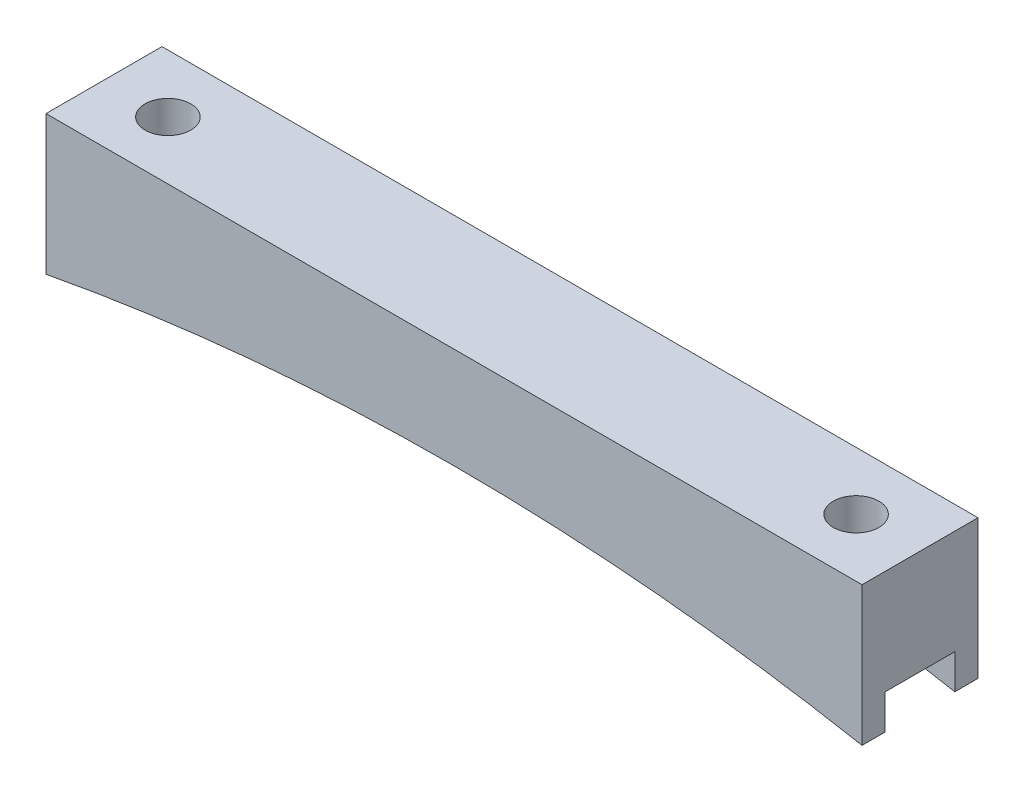
ISO-10303-21;
HEADER;
FILE_DESCRIPTION(('STEP AP214'),'2;1');
FILE_NAME('part.step','',(''),(''),'','','');
FILE_SCHEMA(('AUTOMOTIVE_DESIGN { 1 0 10303 214 1 1 1 1 }'));
ENDSEC;
DATA;
#1=APPLICATION_CONTEXT('core data for automotive mechanical design processes');
#2=APPLICATION_PROTOCOL_DEFINITION('international standard','automotive_design',2000,#1);
#3=PRODUCT_CONTEXT('',#1,'mechanical');
#4=PRODUCT('Part','Part','',(#3));
#5=PRODUCT_RELATED_PRODUCT_CATEGORY('part','',(#4));
#6=PRODUCT_DEFINITION_FORMATION('','',#4);
#7=PRODUCT_DEFINITION_CONTEXT('part definition',#1,'design');
#8=PRODUCT_DEFINITION('design','',#6,#7);
#9=PRODUCT_DEFINITION_SHAPE('','',#8);
#10=(LENGTH_UNIT() NAMED_UNIT(*) SI_UNIT(.MILLI.,.METRE.));
#11=(NAMED_UNIT(*) PLANE_ANGLE_UNIT() SI_UNIT($,.RADIAN.));
#12=(NAMED_UNIT(*) SI_UNIT($,.STERADIAN.) SOLID_ANGLE_UNIT());
#13=UNCERTAINTY_MEASURE_WITH_UNIT(LENGTH_MEASURE(1.E-05),#10,'distance_accuracy_value','');
#14=(GEOMETRIC_REPRESENTATION_CONTEXT(3) GLOBAL_UNCERTAINTY_ASSIGNED_CONTEXT((#13)) GLOBAL_UNIT_ASSIGNED_CONTEXT((#10,
#11,#12)) REPRESENTATION_CONTEXT('',''));
#15=CARTESIAN_POINT('',(0.,0.,0.));
#16=DIRECTION('',(0.,0.,1.));
#17=DIRECTION('',(1.,0.,0.));
#18=AXIS2_PLACEMENT_3D('',#15,#16,#17);
#19=CARTESIAN_POINT('',(44.68,0.,12.7));
#20=DIRECTION('',(-1.,0.,0.));
#21=DIRECTION('',(0.,0.,1.));
#22=AXIS2_PLACEMENT_3D('',#19,#20,#21);
#23=PLANE('',#22);
#24=DIRECTION('',(0.,0.,-1.));
#25=VECTOR('',#24,1.);
#26=CARTESIAN_POINT('',(44.68,-15.24,12.7));
#27=LINE('',#26,#25);
#28=CARTESIAN_POINT('',(44.68,-15.24,12.7));
#29=VERTEX_POINT('',#28);
#30=CARTESIAN_POINT('',(44.68,-15.24,10.16));
#31=VERTEX_POINT('',#30);
#32=EDGE_CURVE('E156',#29,#31,#27,.T.);
#33=ORIENTED_EDGE('',*,*,#32,.T.);
#34=DIRECTION('',(0.,-1.,0.));
#35=VECTOR('',#34,1.);
#36=CARTESIAN_POINT('',(44.68,-15.24,10.16));
#37=LINE('',#36,#35);
#38=CARTESIAN_POINT('',(44.68,-11.43,10.16));
#39=VERTEX_POINT('',#38);
#40=EDGE_CURVE('E185',#39,#31,#37,.T.);
#41=ORIENTED_EDGE('',*,*,#40,.F.);
#42=DIRECTION('',(0.,0.,1.));
#43=VECTOR('',#42,1.);
#44=CARTESIAN_POINT('',(44.68,-11.43,10.16));
#45=LINE('',#44,#43);
#46=CARTESIAN_POINT('',(44.68,-11.43,2.54));
#47=VERTEX_POINT('',#46);
#48=EDGE_CURVE('E141',#47,#39,#45,.T.);
#49=ORIENTED_EDGE('',*,*,#48,.F.);
#50=DIRECTION('',(0.,1.,0.));
#51=VECTOR('',#50,1.);
#52=CARTESIAN_POINT('',(44.68,-15.24,2.54));
#53=LINE('',#52,#51);
#54=CARTESIAN_POINT('',(44.68,-15.24,2.54));
#55=VERTEX_POINT('',#54);
#56=EDGE_CURVE('E177',#55,#47,#53,.T.);
#57=ORIENTED_EDGE('',*,*,#56,.F.);
#58=CARTESIAN_POINT('',(44.68,-15.24,0.));
#59=VERTEX_POINT('',#58);
#60=EDGE_CURVE('E174',#55,#59,#27,.T.);
#61=ORIENTED_EDGE('',*,*,#60,.T.);
#62=DIRECTION('',(0.,1.,0.));
#63=VECTOR('',#62,1.);
#64=CARTESIAN_POINT('',(44.68,0.,0.));
#65=LINE('',#64,#63);
#66=CARTESIAN_POINT('',(44.68,0.,0.));
#67=VERTEX_POINT('',#66);
#68=EDGE_CURVE('E213',#59,#67,#65,.T.);
#69=ORIENTED_EDGE('',*,*,#68,.T.);
#70=DIRECTION('',(0.,0.,-1.));
#71=VECTOR('',#70,1.);
#72=CARTESIAN_POINT('',(44.68,0.,12.7));
#73=LINE('',#72,#71);
#74=CARTESIAN_POINT('',(44.68,0.,12.7));
#75=VERTEX_POINT('',#74);
#76=EDGE_CURVE('E154',#75,#67,#73,.T.);
#77=ORIENTED_EDGE('',*,*,#76,.F.);
#78=DIRECTION('',(0.,1.,0.));
#79=VECTOR('',#78,1.);
#80=CARTESIAN_POINT('',(44.68,0.,12.7));
#81=LINE('',#80,#79);
#82=EDGE_CURVE('E217',#29,#75,#81,.T.);
#83=ORIENTED_EDGE('',*,*,#82,.F.);
#84=EDGE_LOOP('',(#33,#41,#49,#57,#61,#69,#77,#83));
#85=FACE_BOUND('',#84,.T.);
#86=ADVANCED_FACE('F43',(#85),#23,.F.);
#87=CARTESIAN_POINT('',(-44.68,0.,12.7));
#88=DIRECTION('',(0.,-1.,0.));
#89=DIRECTION('',(1.,0.,0.));
#90=AXIS2_PLACEMENT_3D('',#87,#88,#89);
#91=PLANE('',#90);
#92=CARTESIAN_POINT('',(-37.68,0.,6.35));
#93=DIRECTION('',(0.,1.,0.));
#94=DIRECTION('',(-1.,0.,0.));
#95=AXIS2_PLACEMENT_3D('',#92,#93,#94);
#96=CIRCLE('',#95,2.49999999999999);
#97=CARTESIAN_POINT('',(-40.18,0.,6.35));
#98=VERTEX_POINT('',#97);
#99=EDGE_CURVE('E209',#98,#98,#96,.T.);
#100=ORIENTED_EDGE('',*,*,#99,.F.);
#101=EDGE_LOOP('',(#100));
#102=FACE_BOUND('',#101,.T.);
#103=CARTESIAN_POINT('',(37.68,0.,6.35));
#104=DIRECTION('',(0.,1.,0.));
#105=DIRECTION('',(-1.,0.,0.));
#106=AXIS2_PLACEMENT_3D('',#103,#104,#105);
#107=CIRCLE('',#106,2.5);
#108=CARTESIAN_POINT('',(35.18,0.,6.35));
#109=VERTEX_POINT('',#108);
#110=EDGE_CURVE('E208',#109,#109,#107,.T.);
#111=ORIENTED_EDGE('',*,*,#110,.F.);
#112=EDGE_LOOP('',(#111));
#113=FACE_BOUND('',#112,.T.);
#114=DIRECTION('',(-1.,0.,0.));
#115=VECTOR('',#114,1.);
#116=CARTESIAN_POINT('',(-44.68,0.,0.));
#117=LINE('',#116,#115);
#118=CARTESIAN_POINT('',(-44.68,0.,0.));
#119=VERTEX_POINT('',#118);
#120=EDGE_CURVE('E232',#67,#119,#117,.T.);
#121=ORIENTED_EDGE('',*,*,#120,.T.);
#122=DIRECTION('',(0.,0.,-1.));
#123=VECTOR('',#122,1.);
#124=CARTESIAN_POINT('',(-44.68,0.,12.7));
#125=LINE('',#124,#123);
#126=CARTESIAN_POINT('',(-44.68,0.,12.7));
#127=VERTEX_POINT('',#126);
#128=EDGE_CURVE('E148',#127,#119,#125,.T.);
#129=ORIENTED_EDGE('',*,*,#128,.F.);
#130=DIRECTION('',(-1.,0.,0.));
#131=VECTOR('',#130,1.);
#132=CARTESIAN_POINT('',(-44.68,0.,12.7));
#133=LINE('',#132,#131);
#134=EDGE_CURVE('E221',#75,#127,#133,.T.);
#135=ORIENTED_EDGE('',*,*,#134,.F.);
#136=ORIENTED_EDGE('',*,*,#76,.T.);
#137=EDGE_LOOP('',(#121,#129,#135,#136));
#138=FACE_BOUND('',#137,.T.);
#139=ADVANCED_FACE('F247',(#102,#113,#138),#91,.F.);
#140=CARTESIAN_POINT('',(-44.68,0.,12.7));
#141=DIRECTION('',(1.,0.,0.));
#142=DIRECTION('',(0.,0.,-1.));
#143=AXIS2_PLACEMENT_3D('',#140,#141,#142);
#144=PLANE('',#143);
#145=DIRECTION('',(0.,0.,1.));
#146=VECTOR('',#145,1.);
#147=CARTESIAN_POINT('',(-44.68,-11.43,10.16));
#148=LINE('',#147,#146);
#149=CARTESIAN_POINT('',(-44.68,-11.43,2.54));
#150=VERTEX_POINT('',#149);
#151=CARTESIAN_POINT('',(-44.68,-11.43,10.16));
#152=VERTEX_POINT('',#151);
#153=EDGE_CURVE('E139',#150,#152,#148,.T.);
#154=ORIENTED_EDGE('',*,*,#153,.T.);
#155=DIRECTION('',(0.,-1.,0.));
#156=VECTOR('',#155,1.);
#157=CARTESIAN_POINT('',(-44.68,-15.24,10.16));
#158=LINE('',#157,#156);
#159=CARTESIAN_POINT('',(-44.68,-15.24,10.16));
#160=VERTEX_POINT('',#159);
#161=EDGE_CURVE('E124',#152,#160,#158,.T.);
#162=ORIENTED_EDGE('',*,*,#161,.T.);
#163=DIRECTION('',(0.,0.,-1.));
#164=VECTOR('',#163,1.);
#165=CARTESIAN_POINT('',(-44.68,-15.24,12.7));
#166=LINE('',#165,#164);
#167=CARTESIAN_POINT('',(-44.68,-15.24,12.7));
#168=VERTEX_POINT('',#167);
#169=EDGE_CURVE('E136',#168,#160,#166,.T.);
#170=ORIENTED_EDGE('',*,*,#169,.F.);
#171=DIRECTION('',(0.,-1.,0.));
#172=VECTOR('',#171,1.);
#173=CARTESIAN_POINT('',(-44.68,0.,12.7));
#174=LINE('',#173,#172);
#175=EDGE_CURVE('E225',#127,#168,#174,.T.);
#176=ORIENTED_EDGE('',*,*,#175,.F.);
#177=ORIENTED_EDGE('',*,*,#128,.T.);
#178=DIRECTION('',(0.,-1.,0.));
#179=VECTOR('',#178,1.);
#180=CARTESIAN_POINT('',(-44.68,0.,0.));
#181=LINE('',#180,#179);
#182=CARTESIAN_POINT('',(-44.68,-15.24,0.));
#183=VERTEX_POINT('',#182);
#184=EDGE_CURVE('E235',#119,#183,#181,.T.);
#185=ORIENTED_EDGE('',*,*,#184,.T.);
#186=CARTESIAN_POINT('',(-44.68,-15.24,2.54));
#187=VERTEX_POINT('',#186);
#188=EDGE_CURVE('E149',#187,#183,#166,.T.);
#189=ORIENTED_EDGE('',*,*,#188,.F.);
#190=DIRECTION('',(0.,1.,0.));
#191=VECTOR('',#190,1.);
#192=CARTESIAN_POINT('',(-44.68,-15.24,2.54));
#193=LINE('',#192,#191);
#194=EDGE_CURVE('E67',#187,#150,#193,.T.);
#195=ORIENTED_EDGE('',*,*,#194,.T.);
#196=EDGE_LOOP('',(#154,#162,#170,#176,#177,#185,#189,#195));
#197=FACE_BOUND('',#196,.T.);
#198=ADVANCED_FACE('F134',(#197),#144,.F.);
#199=CARTESIAN_POINT('',(0.,-252.367365776285,12.7));
#200=DIRECTION('',(0.,0.,-1.));
#201=DIRECTION('',(-1.,0.,0.));
#202=AXIS2_PLACEMENT_3D('',#199,#200,#201);
#203=CYLINDRICAL_SURFACE('',#202,241.3);
#204=DIRECTION('',(0.,0.,-1.));
#205=VECTOR('',#204,1.);
#206=CARTESIAN_POINT('',(13.2240603743602,-11.43,12.7));
#207=LINE('',#206,#205);
#208=CARTESIAN_POINT('',(13.2240603743602,-11.4300000000001,2.54));
#209=VERTEX_POINT('',#208);
#210=CARTESIAN_POINT('',(13.2240603743602,-11.43,10.16));
#211=VERTEX_POINT('',#210);
#212=EDGE_CURVE('E172',#209,#211,#207,.F.);
#213=ORIENTED_EDGE('',*,*,#212,.T.);
#214=CARTESIAN_POINT('',(0.,-252.367365776285,10.16));
#215=DIRECTION('',(0.,0.,1.));
#216=DIRECTION('',(1.,0.,0.));
#217=AXIS2_PLACEMENT_3D('',#214,#215,#216);
#218=CIRCLE('',#217,241.3);
#219=EDGE_CURVE('E11',#211,#31,#218,.F.);
#220=ORIENTED_EDGE('',*,*,#219,.T.);
#221=ORIENTED_EDGE('',*,*,#32,.F.);
#222=CARTESIAN_POINT('',(0.,-252.367365776285,12.7));
#223=DIRECTION('',(0.,0.,-1.));
#224=DIRECTION('',(-1.,0.,0.));
#225=AXIS2_PLACEMENT_3D('',#222,#223,#224);
#226=CIRCLE('',#225,241.3);
#227=EDGE_CURVE('E146',#168,#29,#226,.T.);
#228=ORIENTED_EDGE('',*,*,#227,.F.);
#229=ORIENTED_EDGE('',*,*,#169,.T.);
#230=CARTESIAN_POINT('',(-13.2240603743602,-11.43,10.16));
#231=VERTEX_POINT('',#230);
#232=EDGE_CURVE('E46',#160,#231,#218,.F.);
#233=ORIENTED_EDGE('',*,*,#232,.T.);
#234=DIRECTION('',(0.,0.,-1.));
#235=VECTOR('',#234,1.);
#236=CARTESIAN_POINT('',(-13.2240603743602,-11.43,12.7));
#237=LINE('',#236,#235);
#238=CARTESIAN_POINT('',(-13.2240603743602,-11.4300000000001,2.54));
#239=VERTEX_POINT('',#238);
#240=EDGE_CURVE('E203',#231,#239,#237,.T.);
#241=ORIENTED_EDGE('',*,*,#240,.T.);
#242=CARTESIAN_POINT('',(0.,-252.367365776285,2.54));
#243=DIRECTION('',(0.,0.,-1.));
#244=DIRECTION('',(-1.,0.,0.));
#245=AXIS2_PLACEMENT_3D('',#242,#243,#244);
#246=CIRCLE('',#245,241.3);
#247=EDGE_CURVE('E131',#239,#187,#246,.F.);
#248=ORIENTED_EDGE('',*,*,#247,.T.);
#249=ORIENTED_EDGE('',*,*,#188,.T.);
#250=CARTESIAN_POINT('',(0.,-252.367365776285,0.));
#251=DIRECTION('',(0.,0.,-1.));
#252=DIRECTION('',(-1.,0.,0.));
#253=AXIS2_PLACEMENT_3D('',#250,#251,#252);
#254=CIRCLE('',#253,241.3);
#255=EDGE_CURVE('E222',#183,#59,#254,.T.);
#256=ORIENTED_EDGE('',*,*,#255,.T.);
#257=ORIENTED_EDGE('',*,*,#60,.F.);
#258=EDGE_CURVE('E52',#55,#209,#246,.F.);
#259=ORIENTED_EDGE('',*,*,#258,.T.);
#260=EDGE_LOOP('',(#213,#220,#221,#228,#229,#233,#241,#248,#249,#256,#257,#259));
#261=FACE_BOUND('',#260,.T.);
#262=ADVANCED_FACE('F144',(#261),#203,.F.);
#263=CARTESIAN_POINT('',(0.,-252.367365776285,12.7));
#264=DIRECTION('',(0.,0.,-1.));
#265=DIRECTION('',(-1.,0.,0.));
#266=AXIS2_PLACEMENT_3D('',#263,#264,#265);
#267=PLANE('',#266);
#268=ORIENTED_EDGE('',*,*,#82,.T.);
#269=ORIENTED_EDGE('',*,*,#134,.T.);
#270=ORIENTED_EDGE('',*,*,#175,.T.);
#271=ORIENTED_EDGE('',*,*,#227,.T.);
#272=EDGE_LOOP('',(#268,#269,#270,#271));
#273=FACE_BOUND('',#272,.T.);
#274=ADVANCED_FACE('F250',(#273),#267,.F.);
#275=CARTESIAN_POINT('',(0.,-252.367365776285,0.));
#276=DIRECTION('',(0.,0.,-1.));
#277=DIRECTION('',(-1.,0.,0.));
#278=AXIS2_PLACEMENT_3D('',#275,#276,#277);
#279=PLANE('',#278);
#280=ORIENTED_EDGE('',*,*,#68,.F.);
#281=ORIENTED_EDGE('',*,*,#255,.F.);
#282=ORIENTED_EDGE('',*,*,#184,.F.);
#283=ORIENTED_EDGE('',*,*,#120,.F.);
#284=EDGE_LOOP('',(#280,#281,#282,#283));
#285=FACE_BOUND('',#284,.T.);
#286=ADVANCED_FACE('F243',(#285),#279,.T.);
#287=CARTESIAN_POINT('',(37.68,-15.24,6.35));
#288=DIRECTION('',(0.,1.,0.));
#289=DIRECTION('',(-1.,0.,0.));
#290=AXIS2_PLACEMENT_3D('',#287,#288,#289);
#291=CYLINDRICAL_SURFACE('',#290,2.5);
#292=CARTESIAN_POINT('',(37.68,-11.43,6.35));
#293=DIRECTION('',(0.,1.,0.));
#294=DIRECTION('',(0.,0.,1.));
#295=AXIS2_PLACEMENT_3D('',#292,#293,#294);
#296=CIRCLE('',#295,2.5);
#297=CARTESIAN_POINT('',(37.68,-11.43,8.85));
#298=VERTEX_POINT('',#297);
#299=EDGE_CURVE('E166',#298,#298,#296,.F.);
#300=ORIENTED_EDGE('',*,*,#299,.T.);
#301=EDGE_LOOP('',(#300));
#302=FACE_BOUND('',#301,.T.);
#303=ORIENTED_EDGE('',*,*,#110,.T.);
#304=EDGE_LOOP('',(#303));
#305=FACE_BOUND('',#304,.T.);
#306=ADVANCED_FACE('F292',(#302,#305),#291,.F.);
#307=CARTESIAN_POINT('',(-37.68,-15.24,6.35));
#308=DIRECTION('',(0.,1.,0.));
#309=DIRECTION('',(-1.,0.,0.));
#310=AXIS2_PLACEMENT_3D('',#307,#308,#309);
#311=CYLINDRICAL_SURFACE('',#310,2.49999999999999);
#312=CARTESIAN_POINT('',(-37.68,-11.43,6.35));
#313=DIRECTION('',(0.,1.,0.));
#314=DIRECTION('',(0.,0.,1.));
#315=AXIS2_PLACEMENT_3D('',#312,#313,#314);
#316=CIRCLE('',#315,2.49999999999999);
#317=CARTESIAN_POINT('',(-37.68,-11.43,8.84999999999999));
#318=VERTEX_POINT('',#317);
#319=EDGE_CURVE('E163',#318,#318,#316,.F.);
#320=ORIENTED_EDGE('',*,*,#319,.T.);
#321=EDGE_LOOP('',(#320));
#322=FACE_BOUND('',#321,.T.);
#323=ORIENTED_EDGE('',*,*,#99,.T.);
#324=EDGE_LOOP('',(#323));
#325=FACE_BOUND('',#324,.T.);
#326=ADVANCED_FACE('F274',(#322,#325),#311,.F.);
#327=CARTESIAN_POINT('',(-44.68,-11.43,10.16));
#328=DIRECTION('',(0.,1.,0.));
#329=DIRECTION('',(0.,0.,1.));
#330=AXIS2_PLACEMENT_3D('',#327,#328,#329);
#331=PLANE('',#330);
#332=ORIENTED_EDGE('',*,*,#319,.F.);
#333=EDGE_LOOP('',(#332));
#334=FACE_BOUND('',#333,.T.);
#335=DIRECTION('',(1.,0.,0.));
#336=VECTOR('',#335,1.);
#337=CARTESIAN_POINT('',(-44.68,-11.43,10.16));
#338=LINE('',#337,#336);
#339=EDGE_CURVE('E126',#152,#231,#338,.T.);
#340=ORIENTED_EDGE('',*,*,#339,.F.);
#341=ORIENTED_EDGE('',*,*,#153,.F.);
#342=DIRECTION('',(1.,0.,0.));
#343=VECTOR('',#342,1.);
#344=CARTESIAN_POINT('',(-44.68,-11.43,2.54));
#345=LINE('',#344,#343);
#346=EDGE_CURVE('E196',#150,#239,#345,.T.);
#347=ORIENTED_EDGE('',*,*,#346,.T.);
#348=ORIENTED_EDGE('',*,*,#240,.F.);
#349=EDGE_LOOP('',(#340,#341,#347,#348));
#350=FACE_BOUND('',#349,.T.);
#351=ADVANCED_FACE('F266',(#334,#350),#331,.F.);
#352=CARTESIAN_POINT('',(-44.68,-15.24,2.54));
#353=DIRECTION('',(0.,0.,-1.));
#354=DIRECTION('',(-1.,0.,0.));
#355=AXIS2_PLACEMENT_3D('',#352,#353,#354);
#356=PLANE('',#355);
#357=ORIENTED_EDGE('',*,*,#346,.F.);
#358=ORIENTED_EDGE('',*,*,#194,.F.);
#359=ORIENTED_EDGE('',*,*,#247,.F.);
#360=EDGE_LOOP('',(#357,#358,#359));
#361=FACE_BOUND('',#360,.T.);
#362=ADVANCED_FACE('F271',(#361),#356,.F.);
#363=CARTESIAN_POINT('',(-44.68,-15.24,10.16));
#364=DIRECTION('',(0.,0.,1.));
#365=DIRECTION('',(1.,0.,0.));
#366=AXIS2_PLACEMENT_3D('',#363,#364,#365);
#367=PLANE('',#366);
#368=ORIENTED_EDGE('',*,*,#161,.F.);
#369=ORIENTED_EDGE('',*,*,#339,.T.);
#370=ORIENTED_EDGE('',*,*,#232,.F.);
#371=EDGE_LOOP('',(#368,#369,#370));
#372=FACE_BOUND('',#371,.T.);
#373=ADVANCED_FACE('F123',(#372),#367,.F.);
#374=EDGE_CURVE('E195',#211,#39,#338,.T.);
#375=ORIENTED_EDGE('',*,*,#374,.T.);
#376=ORIENTED_EDGE('',*,*,#40,.T.);
#377=ORIENTED_EDGE('',*,*,#219,.F.);
#378=EDGE_LOOP('',(#375,#376,#377));
#379=FACE_BOUND('',#378,.T.);
#380=ADVANCED_FACE('F254',(#379),#367,.F.);
#381=ORIENTED_EDGE('',*,*,#56,.T.);
#382=EDGE_CURVE('E59',#209,#47,#345,.T.);
#383=ORIENTED_EDGE('',*,*,#382,.F.);
#384=ORIENTED_EDGE('',*,*,#258,.F.);
#385=EDGE_LOOP('',(#381,#383,#384));
#386=FACE_BOUND('',#385,.T.);
#387=ADVANCED_FACE('F176',(#386),#356,.F.);
#388=ORIENTED_EDGE('',*,*,#299,.F.);
#389=EDGE_LOOP('',(#388));
#390=FACE_BOUND('',#389,.T.);
#391=ORIENTED_EDGE('',*,*,#382,.T.);
#392=ORIENTED_EDGE('',*,*,#48,.T.);
#393=ORIENTED_EDGE('',*,*,#374,.F.);
#394=ORIENTED_EDGE('',*,*,#212,.F.);
#395=EDGE_LOOP('',(#391,#392,#393,#394));
#396=FACE_BOUND('',#395,.T.);
#397=ADVANCED_FACE('F258',(#390,#396),#331,.F.);
#398=CLOSED_SHELL('',(#86,#139,#198,#262,#274,#286,#306,#326,#351,#362,#373,#380,#387,#397));
#399=MANIFOLD_SOLID_BREP('B2',#398);
#400=ADVANCED_BREP_SHAPE_REPRESENTATION('',(#18,#399),#14);
#401=SHAPE_DEFINITION_REPRESENTATION(#9,#400);
ENDSEC;
END-ISO-10303-21;
